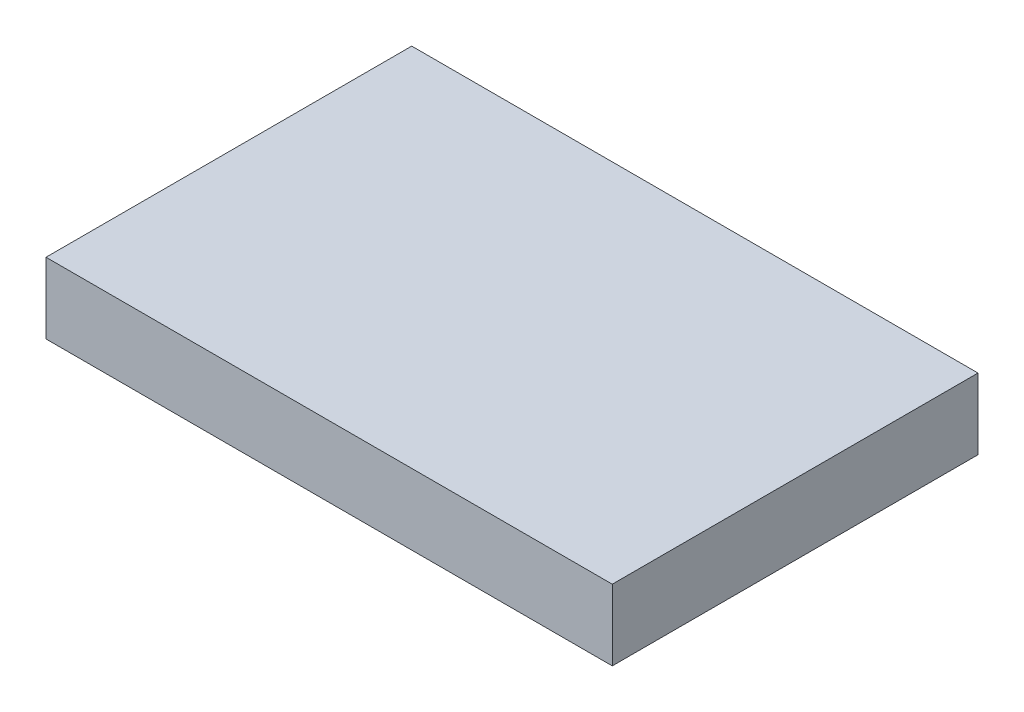
ISO-10303-21;
HEADER;
FILE_DESCRIPTION(('STEP AP214'),'2;1');
FILE_NAME('part.step','',(''),(''),'','','');
FILE_SCHEMA(('AUTOMOTIVE_DESIGN { 1 0 10303 214 1 1 1 1 }'));
ENDSEC;
DATA;
#1=APPLICATION_CONTEXT('core data for automotive mechanical design processes');
#2=APPLICATION_PROTOCOL_DEFINITION('international standard','automotive_design',2000,#1);
#3=PRODUCT_CONTEXT('',#1,'mechanical');
#4=PRODUCT('Part','Part','',(#3));
#5=PRODUCT_RELATED_PRODUCT_CATEGORY('part','',(#4));
#6=PRODUCT_DEFINITION_FORMATION('','',#4);
#7=PRODUCT_DEFINITION_CONTEXT('part definition',#1,'design');
#8=PRODUCT_DEFINITION('design','',#6,#7);
#9=PRODUCT_DEFINITION_SHAPE('','',#8);
#10=(LENGTH_UNIT() NAMED_UNIT(*) SI_UNIT(.MILLI.,.METRE.));
#11=(NAMED_UNIT(*) PLANE_ANGLE_UNIT() SI_UNIT($,.RADIAN.));
#12=(NAMED_UNIT(*) SI_UNIT($,.STERADIAN.) SOLID_ANGLE_UNIT());
#13=UNCERTAINTY_MEASURE_WITH_UNIT(LENGTH_MEASURE(1.E-05),#10,'distance_accuracy_value','');
#14=(GEOMETRIC_REPRESENTATION_CONTEXT(3) GLOBAL_UNCERTAINTY_ASSIGNED_CONTEXT((#13)) GLOBAL_UNIT_ASSIGNED_CONTEXT((#10,
#11,#12)) REPRESENTATION_CONTEXT('',''));
#15=CARTESIAN_POINT('',(0.,0.,0.));
#16=DIRECTION('',(0.,0.,1.));
#17=DIRECTION('',(1.,0.,0.));
#18=AXIS2_PLACEMENT_3D('',#15,#16,#17);
#19=CARTESIAN_POINT('',(30.48,7.62,19.685));
#20=DIRECTION('',(-1.,0.,0.));
#21=DIRECTION('',(0.,0.,1.));
#22=AXIS2_PLACEMENT_3D('',#19,#20,#21);
#23=PLANE('',#22);
#24=DIRECTION('',(0.,0.,-1.));
#25=VECTOR('',#24,1.);
#26=CARTESIAN_POINT('',(30.48,0.,19.685));
#27=LINE('',#26,#25);
#28=CARTESIAN_POINT('',(30.48,0.,19.685));
#29=VERTEX_POINT('',#28);
#30=CARTESIAN_POINT('',(30.48,0.,-19.685));
#31=VERTEX_POINT('',#30);
#32=EDGE_CURVE('E113',#29,#31,#27,.T.);
#33=ORIENTED_EDGE('',*,*,#32,.T.);
#34=DIRECTION('',(0.,-1.,0.));
#35=VECTOR('',#34,1.);
#36=CARTESIAN_POINT('',(30.48,7.62,-19.685));
#37=LINE('',#36,#35);
#38=CARTESIAN_POINT('',(30.48,7.62,-19.685));
#39=VERTEX_POINT('',#38);
#40=EDGE_CURVE('E11',#39,#31,#37,.T.);
#41=ORIENTED_EDGE('',*,*,#40,.F.);
#42=DIRECTION('',(0.,0.,-1.));
#43=VECTOR('',#42,1.);
#44=CARTESIAN_POINT('',(30.48,7.62,19.685));
#45=LINE('',#44,#43);
#46=CARTESIAN_POINT('',(30.48,7.62,19.685));
#47=VERTEX_POINT('',#46);
#48=EDGE_CURVE('E97',#47,#39,#45,.T.);
#49=ORIENTED_EDGE('',*,*,#48,.F.);
#50=DIRECTION('',(0.,-1.,0.));
#51=VECTOR('',#50,1.);
#52=CARTESIAN_POINT('',(30.48,7.62,19.685));
#53=LINE('',#52,#51);
#54=EDGE_CURVE('E109',#47,#29,#53,.T.);
#55=ORIENTED_EDGE('',*,*,#54,.T.);
#56=EDGE_LOOP('',(#33,#41,#49,#55));
#57=FACE_BOUND('',#56,.T.);
#58=ADVANCED_FACE('F45',(#57),#23,.F.);
#59=CARTESIAN_POINT('',(-30.48,7.62,-19.685));
#60=DIRECTION('',(0.,0.,1.));
#61=DIRECTION('',(1.,0.,0.));
#62=AXIS2_PLACEMENT_3D('',#59,#60,#61);
#63=PLANE('',#62);
#64=DIRECTION('',(-1.,0.,0.));
#65=VECTOR('',#64,1.);
#66=CARTESIAN_POINT('',(-30.48,0.,-19.685));
#67=LINE('',#66,#65);
#68=CARTESIAN_POINT('',(-30.48,0.,-19.685));
#69=VERTEX_POINT('',#68);
#70=EDGE_CURVE('E102',#31,#69,#67,.T.);
#71=ORIENTED_EDGE('',*,*,#70,.T.);
#72=DIRECTION('',(0.,-1.,0.));
#73=VECTOR('',#72,1.);
#74=CARTESIAN_POINT('',(-30.48,7.62,-19.685));
#75=LINE('',#74,#73);
#76=CARTESIAN_POINT('',(-30.48,7.62,-19.685));
#77=VERTEX_POINT('',#76);
#78=EDGE_CURVE('E54',#77,#69,#75,.T.);
#79=ORIENTED_EDGE('',*,*,#78,.F.);
#80=DIRECTION('',(-1.,0.,0.));
#81=VECTOR('',#80,1.);
#82=CARTESIAN_POINT('',(-30.48,7.62,-19.685));
#83=LINE('',#82,#81);
#84=EDGE_CURVE('E92',#39,#77,#83,.T.);
#85=ORIENTED_EDGE('',*,*,#84,.F.);
#86=ORIENTED_EDGE('',*,*,#40,.T.);
#87=EDGE_LOOP('',(#71,#79,#85,#86));
#88=FACE_BOUND('',#87,.T.);
#89=ADVANCED_FACE('F101',(#88),#63,.F.);
#90=CARTESIAN_POINT('',(-30.48,7.62,19.685));
#91=DIRECTION('',(1.,0.,0.));
#92=DIRECTION('',(0.,0.,-1.));
#93=AXIS2_PLACEMENT_3D('',#90,#91,#92);
#94=PLANE('',#93);
#95=DIRECTION('',(0.,0.,1.));
#96=VECTOR('',#95,1.);
#97=CARTESIAN_POINT('',(-30.48,0.,19.685));
#98=LINE('',#97,#96);
#99=CARTESIAN_POINT('',(-30.48,0.,19.685));
#100=VERTEX_POINT('',#99);
#101=EDGE_CURVE('E79',#69,#100,#98,.T.);
#102=ORIENTED_EDGE('',*,*,#101,.T.);
#103=DIRECTION('',(0.,-1.,0.));
#104=VECTOR('',#103,1.);
#105=CARTESIAN_POINT('',(-30.48,7.62,19.685));
#106=LINE('',#105,#104);
#107=CARTESIAN_POINT('',(-30.48,7.62,19.685));
#108=VERTEX_POINT('',#107);
#109=EDGE_CURVE('E104',#108,#100,#106,.T.);
#110=ORIENTED_EDGE('',*,*,#109,.F.);
#111=DIRECTION('',(0.,0.,1.));
#112=VECTOR('',#111,1.);
#113=CARTESIAN_POINT('',(-30.48,7.62,19.685));
#114=LINE('',#113,#112);
#115=EDGE_CURVE('E95',#77,#108,#114,.T.);
#116=ORIENTED_EDGE('',*,*,#115,.F.);
#117=ORIENTED_EDGE('',*,*,#78,.T.);
#118=EDGE_LOOP('',(#102,#110,#116,#117));
#119=FACE_BOUND('',#118,.T.);
#120=ADVANCED_FACE('F105',(#119),#94,.F.);
#121=CARTESIAN_POINT('',(-30.48,7.62,19.685));
#122=DIRECTION('',(0.,0.,-1.));
#123=DIRECTION('',(-1.,0.,0.));
#124=AXIS2_PLACEMENT_3D('',#121,#122,#123);
#125=PLANE('',#124);
#126=DIRECTION('',(1.,0.,0.));
#127=VECTOR('',#126,1.);
#128=CARTESIAN_POINT('',(-30.48,0.,19.685));
#129=LINE('',#128,#127);
#130=EDGE_CURVE('E85',#100,#29,#129,.T.);
#131=ORIENTED_EDGE('',*,*,#130,.T.);
#132=ORIENTED_EDGE('',*,*,#54,.F.);
#133=DIRECTION('',(1.,0.,0.));
#134=VECTOR('',#133,1.);
#135=CARTESIAN_POINT('',(-30.48,7.62,19.685));
#136=LINE('',#135,#134);
#137=EDGE_CURVE('E62',#108,#47,#136,.T.);
#138=ORIENTED_EDGE('',*,*,#137,.F.);
#139=ORIENTED_EDGE('',*,*,#109,.T.);
#140=EDGE_LOOP('',(#131,#132,#138,#139));
#141=FACE_BOUND('',#140,.T.);
#142=ADVANCED_FACE('F126',(#141),#125,.F.);
#143=CARTESIAN_POINT('',(0.,7.62,0.));
#144=DIRECTION('',(0.,-1.,0.));
#145=DIRECTION('',(0.,0.,-1.));
#146=AXIS2_PLACEMENT_3D('',#143,#144,#145);
#147=PLANE('',#146);
#148=ORIENTED_EDGE('',*,*,#48,.T.);
#149=ORIENTED_EDGE('',*,*,#84,.T.);
#150=ORIENTED_EDGE('',*,*,#115,.T.);
#151=ORIENTED_EDGE('',*,*,#137,.T.);
#152=EDGE_LOOP('',(#148,#149,#150,#151));
#153=FACE_BOUND('',#152,.T.);
#154=ADVANCED_FACE('F93',(#153),#147,.F.);
#155=CARTESIAN_POINT('',(0.,0.,0.));
#156=DIRECTION('',(0.,-1.,0.));
#157=DIRECTION('',(0.,0.,-1.));
#158=AXIS2_PLACEMENT_3D('',#155,#156,#157);
#159=PLANE('',#158);
#160=ORIENTED_EDGE('',*,*,#32,.F.);
#161=ORIENTED_EDGE('',*,*,#130,.F.);
#162=ORIENTED_EDGE('',*,*,#101,.F.);
#163=ORIENTED_EDGE('',*,*,#70,.F.);
#164=EDGE_LOOP('',(#160,#161,#162,#163));
#165=FACE_BOUND('',#164,.T.);
#166=ADVANCED_FACE('F129',(#165),#159,.T.);
#167=CLOSED_SHELL('',(#58,#89,#120,#142,#154,#166));
#168=MANIFOLD_SOLID_BREP('B2',#167);
#169=ADVANCED_BREP_SHAPE_REPRESENTATION('',(#18,#168),#14);
#170=SHAPE_DEFINITION_REPRESENTATION(#9,#169);
ENDSEC;
END-ISO-10303-21;
